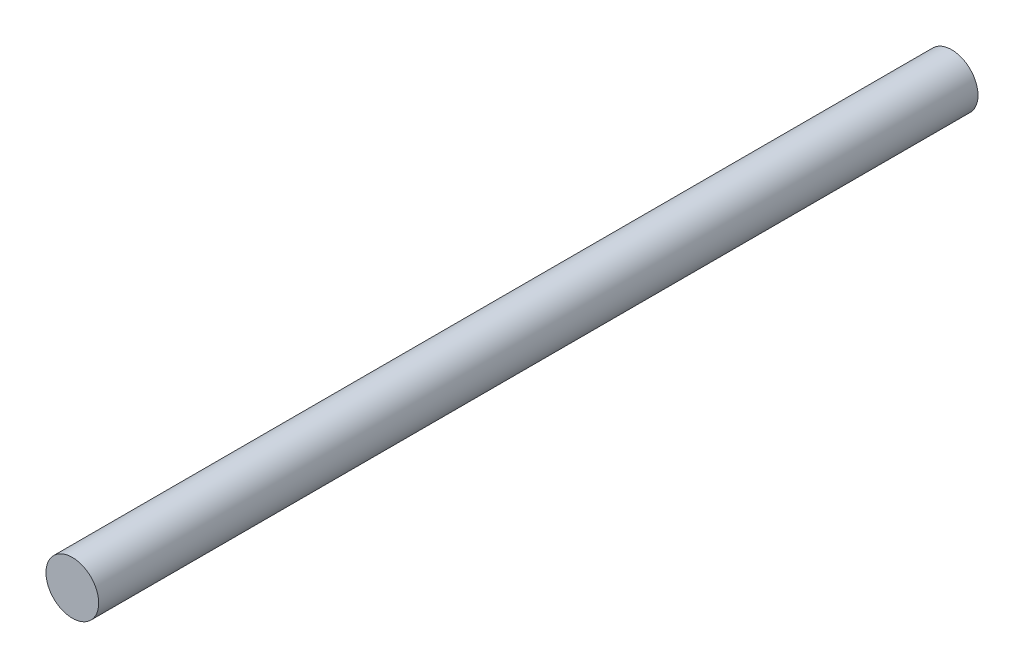
ISO-10303-21;
HEADER;
FILE_DESCRIPTION(('STEP AP214'),'2;1');
FILE_NAME('part.step','',(''),(''),'','','');
FILE_SCHEMA(('AUTOMOTIVE_DESIGN { 1 0 10303 214 1 1 1 1 }'));
ENDSEC;
DATA;
#1=APPLICATION_CONTEXT('core data for automotive mechanical design processes');
#2=APPLICATION_PROTOCOL_DEFINITION('international standard','automotive_design',2000,#1);
#3=PRODUCT_CONTEXT('',#1,'mechanical');
#4=PRODUCT('Part','Part','',(#3));
#5=PRODUCT_RELATED_PRODUCT_CATEGORY('part','',(#4));
#6=PRODUCT_DEFINITION_FORMATION('','',#4);
#7=PRODUCT_DEFINITION_CONTEXT('part definition',#1,'design');
#8=PRODUCT_DEFINITION('design','',#6,#7);
#9=PRODUCT_DEFINITION_SHAPE('','',#8);
#10=(LENGTH_UNIT() NAMED_UNIT(*) SI_UNIT(.MILLI.,.METRE.));
#11=(NAMED_UNIT(*) PLANE_ANGLE_UNIT() SI_UNIT($,.RADIAN.));
#12=(NAMED_UNIT(*) SI_UNIT($,.STERADIAN.) SOLID_ANGLE_UNIT());
#13=UNCERTAINTY_MEASURE_WITH_UNIT(LENGTH_MEASURE(1.E-05),#10,'distance_accuracy_value','');
#14=(GEOMETRIC_REPRESENTATION_CONTEXT(3) GLOBAL_UNCERTAINTY_ASSIGNED_CONTEXT((#13)) GLOBAL_UNIT_ASSIGNED_CONTEXT((#10,
#11,#12)) REPRESENTATION_CONTEXT('',''));
#15=CARTESIAN_POINT('',(0.,0.,0.));
#16=DIRECTION('',(0.,0.,1.));
#17=DIRECTION('',(1.,0.,0.));
#18=AXIS2_PLACEMENT_3D('',#15,#16,#17);
#19=CARTESIAN_POINT('',(0.,0.,1000.));
#20=DIRECTION('',(0.,0.,-1.));
#21=DIRECTION('',(-1.,0.,0.));
#22=AXIS2_PLACEMENT_3D('',#19,#20,#21);
#23=CYLINDRICAL_SURFACE('',#22,30.);
#24=CARTESIAN_POINT('',(0.,0.,1000.));
#25=DIRECTION('',(0.,0.,1.));
#26=DIRECTION('',(1.,0.,0.));
#27=AXIS2_PLACEMENT_3D('',#24,#25,#26);
#28=CIRCLE('',#27,30.);
#29=CARTESIAN_POINT('',(30.,0.,1000.));
#30=VERTEX_POINT('',#29);
#31=EDGE_CURVE('E10',#30,#30,#28,.T.);
#32=ORIENTED_EDGE('',*,*,#31,.F.);
#33=EDGE_LOOP('',(#32));
#34=FACE_BOUND('',#33,.T.);
#35=CARTESIAN_POINT('',(0.,0.,0.));
#36=DIRECTION('',(0.,0.,1.));
#37=DIRECTION('',(1.,0.,0.));
#38=AXIS2_PLACEMENT_3D('',#35,#36,#37);
#39=CIRCLE('',#38,30.);
#40=CARTESIAN_POINT('',(30.,0.,0.));
#41=VERTEX_POINT('',#40);
#42=EDGE_CURVE('E33',#41,#41,#39,.T.);
#43=ORIENTED_EDGE('',*,*,#42,.T.);
#44=EDGE_LOOP('',(#43));
#45=FACE_BOUND('',#44,.T.);
#46=ADVANCED_FACE('F30',(#34,#45),#23,.T.);
#47=CARTESIAN_POINT('',(0.,0.,1000.));
#48=DIRECTION('',(0.,0.,1.));
#49=DIRECTION('',(1.,0.,0.));
#50=AXIS2_PLACEMENT_3D('',#47,#48,#49);
#51=PLANE('',#50);
#52=ORIENTED_EDGE('',*,*,#31,.T.);
#53=EDGE_LOOP('',(#52));
#54=FACE_BOUND('',#53,.T.);
#55=ADVANCED_FACE('F45',(#54),#51,.T.);
#56=CARTESIAN_POINT('',(0.,0.,0.));
#57=DIRECTION('',(0.,0.,1.));
#58=DIRECTION('',(1.,0.,0.));
#59=AXIS2_PLACEMENT_3D('',#56,#57,#58);
#60=PLANE('',#59);
#61=ORIENTED_EDGE('',*,*,#42,.F.);
#62=EDGE_LOOP('',(#61));
#63=FACE_BOUND('',#62,.T.);
#64=ADVANCED_FACE('F43',(#63),#60,.F.);
#65=CLOSED_SHELL('',(#46,#55,#64));
#66=MANIFOLD_SOLID_BREP('B2',#65);
#67=ADVANCED_BREP_SHAPE_REPRESENTATION('',(#18,#66),#14);
#68=SHAPE_DEFINITION_REPRESENTATION(#9,#67);
ENDSEC;
END-ISO-10303-21;
